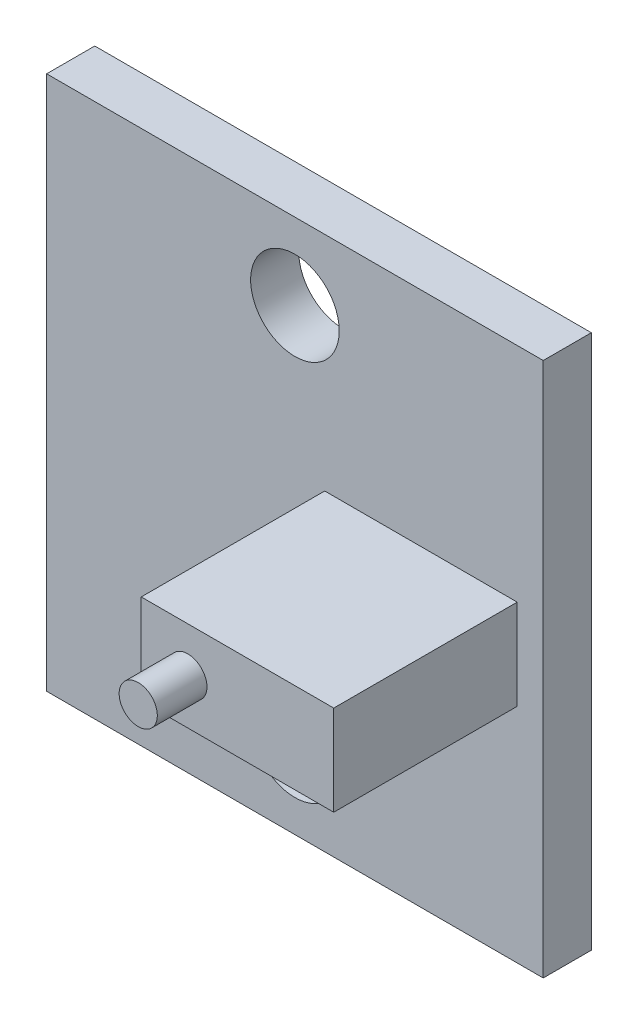
ISO-10303-21;
HEADER;
FILE_DESCRIPTION(('STEP AP214'),'2;1');
FILE_NAME('part.step','',(''),(''),'','','');
FILE_SCHEMA(('AUTOMOTIVE_DESIGN { 1 0 10303 214 1 1 1 1 }'));
ENDSEC;
DATA;
#1=APPLICATION_CONTEXT('core data for automotive mechanical design processes');
#2=APPLICATION_PROTOCOL_DEFINITION('international standard','automotive_design',2000,#1);
#3=PRODUCT_CONTEXT('',#1,'mechanical');
#4=PRODUCT('Part','Part','',(#3));
#5=PRODUCT_RELATED_PRODUCT_CATEGORY('part','',(#4));
#6=PRODUCT_DEFINITION_FORMATION('','',#4);
#7=PRODUCT_DEFINITION_CONTEXT('part definition',#1,'design');
#8=PRODUCT_DEFINITION('design','',#6,#7);
#9=PRODUCT_DEFINITION_SHAPE('','',#8);
#10=(LENGTH_UNIT() NAMED_UNIT(*) SI_UNIT(.MILLI.,.METRE.));
#11=(NAMED_UNIT(*) PLANE_ANGLE_UNIT() SI_UNIT($,.RADIAN.));
#12=(NAMED_UNIT(*) SI_UNIT($,.STERADIAN.) SOLID_ANGLE_UNIT());
#13=UNCERTAINTY_MEASURE_WITH_UNIT(LENGTH_MEASURE(1.E-05),#10,'distance_accuracy_value','');
#14=(GEOMETRIC_REPRESENTATION_CONTEXT(3) GLOBAL_UNCERTAINTY_ASSIGNED_CONTEXT((#13)) GLOBAL_UNIT_ASSIGNED_CONTEXT((#10,
#11,#12)) REPRESENTATION_CONTEXT('',''));
#15=CARTESIAN_POINT('',(0.,0.,0.));
#16=DIRECTION('',(0.,0.,1.));
#17=DIRECTION('',(1.,0.,0.));
#18=AXIS2_PLACEMENT_3D('',#15,#16,#17);
#19=CARTESIAN_POINT('',(0.,0.,1.6));
#20=DIRECTION('',(0.,0.,1.));
#21=DIRECTION('',(1.,0.,0.));
#22=AXIS2_PLACEMENT_3D('',#19,#20,#21);
#23=PLANE('',#22);
#24=CARTESIAN_POINT('',(0.,6.35,1.6));
#25=DIRECTION('',(0.,0.,1.));
#26=DIRECTION('',(1.,0.,0.));
#27=AXIS2_PLACEMENT_3D('',#24,#25,#26);
#28=CIRCLE('',#27,1.4732);
#29=CARTESIAN_POINT('',(1.4732,6.35,1.6));
#30=VERTEX_POINT('',#29);
#31=EDGE_CURVE('E135',#30,#30,#28,.T.);
#32=ORIENTED_EDGE('',*,*,#31,.F.);
#33=EDGE_LOOP('',(#32));
#34=FACE_BOUND('',#33,.T.);
#35=CARTESIAN_POINT('',(0.,-6.35,1.6));
#36=DIRECTION('',(0.,0.,1.));
#37=DIRECTION('',(1.,0.,0.));
#38=AXIS2_PLACEMENT_3D('',#35,#36,#37);
#39=CIRCLE('',#38,1.4732);
#40=CARTESIAN_POINT('',(1.4732,-6.35,1.6));
#41=VERTEX_POINT('',#40);
#42=EDGE_CURVE('E145',#41,#41,#39,.T.);
#43=ORIENTED_EDGE('',*,*,#42,.F.);
#44=EDGE_LOOP('',(#43));
#45=FACE_BOUND('',#44,.T.);
#46=DIRECTION('',(0.,-1.,0.));
#47=VECTOR('',#46,1.);
#48=CARTESIAN_POINT('',(-8.255,-8.89,1.6));
#49=LINE('',#48,#47);
#50=CARTESIAN_POINT('',(-8.255,8.89,1.6));
#51=VERTEX_POINT('',#50);
#52=CARTESIAN_POINT('',(-8.255,-8.89,1.6));
#53=VERTEX_POINT('',#52);
#54=EDGE_CURVE('E148',#51,#53,#49,.T.);
#55=ORIENTED_EDGE('',*,*,#54,.T.);
#56=DIRECTION('',(1.,0.,0.));
#57=VECTOR('',#56,1.);
#58=CARTESIAN_POINT('',(8.255,-8.89,1.6));
#59=LINE('',#58,#57);
#60=CARTESIAN_POINT('',(8.255,-8.89,1.6));
#61=VERTEX_POINT('',#60);
#62=EDGE_CURVE('E88',#53,#61,#59,.T.);
#63=ORIENTED_EDGE('',*,*,#62,.T.);
#64=DIRECTION('',(0.,1.,0.));
#65=VECTOR('',#64,1.);
#66=CARTESIAN_POINT('',(8.255,-8.89,1.6));
#67=LINE('',#66,#65);
#68=CARTESIAN_POINT('',(8.255,8.89,1.6));
#69=VERTEX_POINT('',#68);
#70=EDGE_CURVE('E151',#61,#69,#67,.T.);
#71=ORIENTED_EDGE('',*,*,#70,.T.);
#72=DIRECTION('',(-1.,0.,0.));
#73=VECTOR('',#72,1.);
#74=CARTESIAN_POINT('',(8.255,8.89,1.6));
#75=LINE('',#74,#73);
#76=EDGE_CURVE('E60',#69,#51,#75,.T.);
#77=ORIENTED_EDGE('',*,*,#76,.T.);
#78=EDGE_LOOP('',(#55,#63,#71,#77));
#79=FACE_BOUND('',#78,.T.);
#80=DIRECTION('',(-1.,0.,0.));
#81=VECTOR('',#80,1.);
#82=CARTESIAN_POINT('',(0.99,1.5,1.6));
#83=LINE('',#82,#81);
#84=CARTESIAN_POINT('',(7.39,1.5,1.6));
#85=VERTEX_POINT('',#84);
#86=CARTESIAN_POINT('',(0.99,1.5,1.6));
#87=VERTEX_POINT('',#86);
#88=EDGE_CURVE('E234',#85,#87,#83,.T.);
#89=ORIENTED_EDGE('',*,*,#88,.F.);
#90=DIRECTION('',(0.,1.,0.));
#91=VECTOR('',#90,1.);
#92=CARTESIAN_POINT('',(7.39,1.5,1.6));
#93=LINE('',#92,#91);
#94=CARTESIAN_POINT('',(7.39,-1.5,1.6));
#95=VERTEX_POINT('',#94);
#96=EDGE_CURVE('E133',#95,#85,#93,.T.);
#97=ORIENTED_EDGE('',*,*,#96,.F.);
#98=DIRECTION('',(1.,0.,0.));
#99=VECTOR('',#98,1.);
#100=CARTESIAN_POINT('',(0.990000000000001,-1.5,1.6));
#101=LINE('',#100,#99);
#102=CARTESIAN_POINT('',(0.990000000000001,-1.5,1.6));
#103=VERTEX_POINT('',#102);
#104=EDGE_CURVE('E129',#103,#95,#101,.T.);
#105=ORIENTED_EDGE('',*,*,#104,.F.);
#106=DIRECTION('',(0.,-1.,0.));
#107=VECTOR('',#106,1.);
#108=CARTESIAN_POINT('',(0.99,1.5,1.6));
#109=LINE('',#108,#107);
#110=EDGE_CURVE('E243',#87,#103,#109,.T.);
#111=ORIENTED_EDGE('',*,*,#110,.F.);
#112=EDGE_LOOP('',(#89,#97,#105,#111));
#113=FACE_BOUND('',#112,.T.);
#114=ADVANCED_FACE('F35',(#34,#45,#79,#113),#23,.T.);
#115=CARTESIAN_POINT('',(-8.255,-8.89,1.6));
#116=DIRECTION('',(1.,0.,0.));
#117=DIRECTION('',(0.,0.,-1.));
#118=AXIS2_PLACEMENT_3D('',#115,#116,#117);
#119=PLANE('',#118);
#120=DIRECTION('',(0.,-1.,0.));
#121=VECTOR('',#120,1.);
#122=CARTESIAN_POINT('',(-8.255,-8.89,0.));
#123=LINE('',#122,#121);
#124=CARTESIAN_POINT('',(-8.255,8.89,0.));
#125=VERTEX_POINT('',#124);
#126=CARTESIAN_POINT('',(-8.255,-8.89,0.));
#127=VERTEX_POINT('',#126);
#128=EDGE_CURVE('E155',#125,#127,#123,.T.);
#129=ORIENTED_EDGE('',*,*,#128,.T.);
#130=DIRECTION('',(0.,0.,-1.));
#131=VECTOR('',#130,1.);
#132=CARTESIAN_POINT('',(-8.255,-8.89,1.6));
#133=LINE('',#132,#131);
#134=EDGE_CURVE('E11',#53,#127,#133,.T.);
#135=ORIENTED_EDGE('',*,*,#134,.F.);
#136=ORIENTED_EDGE('',*,*,#54,.F.);
#137=DIRECTION('',(0.,0.,-1.));
#138=VECTOR('',#137,1.);
#139=CARTESIAN_POINT('',(-8.255,8.89,1.6));
#140=LINE('',#139,#138);
#141=EDGE_CURVE('E154',#51,#125,#140,.T.);
#142=ORIENTED_EDGE('',*,*,#141,.T.);
#143=EDGE_LOOP('',(#129,#135,#136,#142));
#144=FACE_BOUND('',#143,.T.);
#145=ADVANCED_FACE('F37',(#144),#119,.F.);
#146=CARTESIAN_POINT('',(8.255,-8.89,1.6));
#147=DIRECTION('',(0.,1.,0.));
#148=DIRECTION('',(-1.,0.,0.));
#149=AXIS2_PLACEMENT_3D('',#146,#147,#148);
#150=PLANE('',#149);
#151=DIRECTION('',(1.,0.,0.));
#152=VECTOR('',#151,1.);
#153=CARTESIAN_POINT('',(8.255,-8.89,0.));
#154=LINE('',#153,#152);
#155=CARTESIAN_POINT('',(8.255,-8.89,0.));
#156=VERTEX_POINT('',#155);
#157=EDGE_CURVE('E158',#127,#156,#154,.T.);
#158=ORIENTED_EDGE('',*,*,#157,.T.);
#159=DIRECTION('',(0.,0.,-1.));
#160=VECTOR('',#159,1.);
#161=CARTESIAN_POINT('',(8.255,-8.89,1.6));
#162=LINE('',#161,#160);
#163=EDGE_CURVE('E44',#61,#156,#162,.T.);
#164=ORIENTED_EDGE('',*,*,#163,.F.);
#165=ORIENTED_EDGE('',*,*,#62,.F.);
#166=ORIENTED_EDGE('',*,*,#134,.T.);
#167=EDGE_LOOP('',(#158,#164,#165,#166));
#168=FACE_BOUND('',#167,.T.);
#169=ADVANCED_FACE('F188',(#168),#150,.F.);
#170=CARTESIAN_POINT('',(8.255,-8.89,1.6));
#171=DIRECTION('',(-1.,0.,0.));
#172=DIRECTION('',(0.,0.,1.));
#173=AXIS2_PLACEMENT_3D('',#170,#171,#172);
#174=PLANE('',#173);
#175=DIRECTION('',(0.,1.,0.));
#176=VECTOR('',#175,1.);
#177=CARTESIAN_POINT('',(8.255,-8.89,0.));
#178=LINE('',#177,#176);
#179=CARTESIAN_POINT('',(8.255,8.89,0.));
#180=VERTEX_POINT('',#179);
#181=EDGE_CURVE('E160',#156,#180,#178,.T.);
#182=ORIENTED_EDGE('',*,*,#181,.T.);
#183=DIRECTION('',(0.,0.,-1.));
#184=VECTOR('',#183,1.);
#185=CARTESIAN_POINT('',(8.255,8.89,1.6));
#186=LINE('',#185,#184);
#187=EDGE_CURVE('E164',#69,#180,#186,.T.);
#188=ORIENTED_EDGE('',*,*,#187,.F.);
#189=ORIENTED_EDGE('',*,*,#70,.F.);
#190=ORIENTED_EDGE('',*,*,#163,.T.);
#191=EDGE_LOOP('',(#182,#188,#189,#190));
#192=FACE_BOUND('',#191,.T.);
#193=ADVANCED_FACE('F170',(#192),#174,.F.);
#194=CARTESIAN_POINT('',(8.255,8.89,1.6));
#195=DIRECTION('',(0.,-1.,0.));
#196=DIRECTION('',(1.,0.,0.));
#197=AXIS2_PLACEMENT_3D('',#194,#195,#196);
#198=PLANE('',#197);
#199=DIRECTION('',(-1.,0.,0.));
#200=VECTOR('',#199,1.);
#201=CARTESIAN_POINT('',(8.255,8.89,0.));
#202=LINE('',#201,#200);
#203=EDGE_CURVE('E81',#180,#125,#202,.T.);
#204=ORIENTED_EDGE('',*,*,#203,.T.);
#205=ORIENTED_EDGE('',*,*,#141,.F.);
#206=ORIENTED_EDGE('',*,*,#76,.F.);
#207=ORIENTED_EDGE('',*,*,#187,.T.);
#208=EDGE_LOOP('',(#204,#205,#206,#207));
#209=FACE_BOUND('',#208,.T.);
#210=ADVANCED_FACE('F178',(#209),#198,.F.);
#211=CARTESIAN_POINT('',(0.,0.,0.));
#212=DIRECTION('',(0.,0.,1.));
#213=DIRECTION('',(1.,0.,0.));
#214=AXIS2_PLACEMENT_3D('',#211,#212,#213);
#215=PLANE('',#214);
#216=CARTESIAN_POINT('',(0.,6.35,0.));
#217=DIRECTION('',(0.,0.,1.));
#218=DIRECTION('',(1.,0.,0.));
#219=AXIS2_PLACEMENT_3D('',#216,#217,#218);
#220=CIRCLE('',#219,1.4732);
#221=CARTESIAN_POINT('',(1.4732,6.35,0.));
#222=VERTEX_POINT('',#221);
#223=EDGE_CURVE('E138',#222,#222,#220,.T.);
#224=ORIENTED_EDGE('',*,*,#223,.T.);
#225=EDGE_LOOP('',(#224));
#226=FACE_BOUND('',#225,.T.);
#227=CARTESIAN_POINT('',(0.,-6.35,0.));
#228=DIRECTION('',(0.,0.,1.));
#229=DIRECTION('',(1.,0.,0.));
#230=AXIS2_PLACEMENT_3D('',#227,#228,#229);
#231=CIRCLE('',#230,1.4732);
#232=CARTESIAN_POINT('',(1.4732,-6.35,0.));
#233=VERTEX_POINT('',#232);
#234=EDGE_CURVE('E39',#233,#233,#231,.T.);
#235=ORIENTED_EDGE('',*,*,#234,.T.);
#236=EDGE_LOOP('',(#235));
#237=FACE_BOUND('',#236,.T.);
#238=ORIENTED_EDGE('',*,*,#128,.F.);
#239=ORIENTED_EDGE('',*,*,#203,.F.);
#240=ORIENTED_EDGE('',*,*,#181,.F.);
#241=ORIENTED_EDGE('',*,*,#157,.F.);
#242=EDGE_LOOP('',(#238,#239,#240,#241));
#243=FACE_BOUND('',#242,.T.);
#244=ADVANCED_FACE('F174',(#226,#237,#243),#215,.F.);
#245=CARTESIAN_POINT('',(0.,-6.35,1.6));
#246=DIRECTION('',(0.,0.,1.));
#247=DIRECTION('',(1.,0.,0.));
#248=AXIS2_PLACEMENT_3D('',#245,#246,#247);
#249=CYLINDRICAL_SURFACE('',#248,1.4732);
#250=ORIENTED_EDGE('',*,*,#42,.T.);
#251=EDGE_LOOP('',(#250));
#252=FACE_BOUND('',#251,.T.);
#253=ORIENTED_EDGE('',*,*,#234,.F.);
#254=EDGE_LOOP('',(#253));
#255=FACE_BOUND('',#254,.T.);
#256=ADVANCED_FACE('F185',(#252,#255),#249,.F.);
#257=CARTESIAN_POINT('',(0.,6.35,1.6));
#258=DIRECTION('',(0.,0.,1.));
#259=DIRECTION('',(1.,0.,0.));
#260=AXIS2_PLACEMENT_3D('',#257,#258,#259);
#261=CYLINDRICAL_SURFACE('',#260,1.4732);
#262=ORIENTED_EDGE('',*,*,#31,.T.);
#263=EDGE_LOOP('',(#262));
#264=FACE_BOUND('',#263,.T.);
#265=ORIENTED_EDGE('',*,*,#223,.F.);
#266=EDGE_LOOP('',(#265));
#267=FACE_BOUND('',#266,.T.);
#268=ADVANCED_FACE('F201',(#264,#267),#261,.F.);
#269=CARTESIAN_POINT('',(7.39,1.5,7.7));
#270=DIRECTION('',(-1.,0.,0.));
#271=DIRECTION('',(0.,0.,1.));
#272=AXIS2_PLACEMENT_3D('',#269,#270,#271);
#273=PLANE('',#272);
#274=ORIENTED_EDGE('',*,*,#96,.T.);
#275=DIRECTION('',(0.,0.,-1.));
#276=VECTOR('',#275,1.);
#277=CARTESIAN_POINT('',(7.39,1.5,7.7));
#278=LINE('',#277,#276);
#279=CARTESIAN_POINT('',(7.39,1.5,7.7));
#280=VERTEX_POINT('',#279);
#281=EDGE_CURVE('E114',#280,#85,#278,.T.);
#282=ORIENTED_EDGE('',*,*,#281,.F.);
#283=DIRECTION('',(0.,1.,0.));
#284=VECTOR('',#283,1.);
#285=CARTESIAN_POINT('',(7.39,1.5,7.7));
#286=LINE('',#285,#284);
#287=CARTESIAN_POINT('',(7.39,-1.5,7.7));
#288=VERTEX_POINT('',#287);
#289=EDGE_CURVE('E121',#288,#280,#286,.T.);
#290=ORIENTED_EDGE('',*,*,#289,.F.);
#291=DIRECTION('',(0.,0.,-1.));
#292=VECTOR('',#291,1.);
#293=CARTESIAN_POINT('',(7.39,-1.5,7.7));
#294=LINE('',#293,#292);
#295=EDGE_CURVE('E240',#288,#95,#294,.T.);
#296=ORIENTED_EDGE('',*,*,#295,.T.);
#297=EDGE_LOOP('',(#274,#282,#290,#296));
#298=FACE_BOUND('',#297,.T.);
#299=ADVANCED_FACE('F131',(#298),#273,.F.);
#300=CARTESIAN_POINT('',(0.99,1.5,7.7));
#301=DIRECTION('',(0.,-1.,0.));
#302=DIRECTION('',(0.,0.,-1.));
#303=AXIS2_PLACEMENT_3D('',#300,#301,#302);
#304=PLANE('',#303);
#305=ORIENTED_EDGE('',*,*,#88,.T.);
#306=DIRECTION('',(0.,0.,-1.));
#307=VECTOR('',#306,1.);
#308=CARTESIAN_POINT('',(0.99,1.5,7.7));
#309=LINE('',#308,#307);
#310=CARTESIAN_POINT('',(0.99,1.5,7.7));
#311=VERTEX_POINT('',#310);
#312=EDGE_CURVE('E117',#311,#87,#309,.T.);
#313=ORIENTED_EDGE('',*,*,#312,.F.);
#314=DIRECTION('',(-1.,0.,0.));
#315=VECTOR('',#314,1.);
#316=CARTESIAN_POINT('',(0.99,1.5,7.7));
#317=LINE('',#316,#315);
#318=EDGE_CURVE('E110',#280,#311,#317,.T.);
#319=ORIENTED_EDGE('',*,*,#318,.F.);
#320=ORIENTED_EDGE('',*,*,#281,.T.);
#321=EDGE_LOOP('',(#305,#313,#319,#320));
#322=FACE_BOUND('',#321,.T.);
#323=ADVANCED_FACE('F112',(#322),#304,.F.);
#324=CARTESIAN_POINT('',(0.99,1.5,7.7));
#325=DIRECTION('',(1.,0.,0.));
#326=DIRECTION('',(0.,1.,0.));
#327=AXIS2_PLACEMENT_3D('',#324,#325,#326);
#328=PLANE('',#327);
#329=ORIENTED_EDGE('',*,*,#110,.T.);
#330=DIRECTION('',(0.,0.,-1.));
#331=VECTOR('',#330,1.);
#332=CARTESIAN_POINT('',(0.990000000000001,-1.5,7.7));
#333=LINE('',#332,#331);
#334=CARTESIAN_POINT('',(0.990000000000001,-1.5,7.7));
#335=VERTEX_POINT('',#334);
#336=EDGE_CURVE('E51',#335,#103,#333,.T.);
#337=ORIENTED_EDGE('',*,*,#336,.F.);
#338=DIRECTION('',(0.,-1.,0.));
#339=VECTOR('',#338,1.);
#340=CARTESIAN_POINT('',(0.99,1.5,7.7));
#341=LINE('',#340,#339);
#342=EDGE_CURVE('E120',#311,#335,#341,.T.);
#343=ORIENTED_EDGE('',*,*,#342,.F.);
#344=ORIENTED_EDGE('',*,*,#312,.T.);
#345=EDGE_LOOP('',(#329,#337,#343,#344));
#346=FACE_BOUND('',#345,.T.);
#347=ADVANCED_FACE('F210',(#346),#328,.F.);
#348=CARTESIAN_POINT('',(0.990000000000001,-1.5,7.7));
#349=DIRECTION('',(0.,1.,0.));
#350=DIRECTION('',(0.,0.,1.));
#351=AXIS2_PLACEMENT_3D('',#348,#349,#350);
#352=PLANE('',#351);
#353=ORIENTED_EDGE('',*,*,#104,.T.);
#354=ORIENTED_EDGE('',*,*,#295,.F.);
#355=DIRECTION('',(1.,0.,0.));
#356=VECTOR('',#355,1.);
#357=CARTESIAN_POINT('',(0.990000000000001,-1.5,7.7));
#358=LINE('',#357,#356);
#359=EDGE_CURVE('E125',#335,#288,#358,.T.);
#360=ORIENTED_EDGE('',*,*,#359,.F.);
#361=ORIENTED_EDGE('',*,*,#336,.T.);
#362=EDGE_LOOP('',(#353,#354,#360,#361));
#363=FACE_BOUND('',#362,.T.);
#364=ADVANCED_FACE('F213',(#363),#352,.F.);
#365=CARTESIAN_POINT('',(0.,0.,7.7));
#366=DIRECTION('',(0.,0.,1.));
#367=DIRECTION('',(1.,0.,0.));
#368=AXIS2_PLACEMENT_3D('',#365,#366,#367);
#369=PLANE('',#368);
#370=CARTESIAN_POINT('',(2.54,0.,7.7));
#371=DIRECTION('',(0.,0.,1.));
#372=DIRECTION('',(1.,0.,0.));
#373=AXIS2_PLACEMENT_3D('',#370,#371,#372);
#374=CIRCLE('',#373,0.635);
#375=CARTESIAN_POINT('',(3.175,0.,7.7));
#376=VERTEX_POINT('',#375);
#377=EDGE_CURVE('E232',#376,#376,#374,.T.);
#378=ORIENTED_EDGE('',*,*,#377,.F.);
#379=EDGE_LOOP('',(#378));
#380=FACE_BOUND('',#379,.T.);
#381=ORIENTED_EDGE('',*,*,#289,.T.);
#382=ORIENTED_EDGE('',*,*,#318,.T.);
#383=ORIENTED_EDGE('',*,*,#342,.T.);
#384=ORIENTED_EDGE('',*,*,#359,.T.);
#385=EDGE_LOOP('',(#381,#382,#383,#384));
#386=FACE_BOUND('',#385,.T.);
#387=ADVANCED_FACE('F124',(#380,#386),#369,.T.);
#388=CARTESIAN_POINT('',(2.54,0.,9.35));
#389=DIRECTION('',(0.,0.,-1.));
#390=DIRECTION('',(-1.,0.,0.));
#391=AXIS2_PLACEMENT_3D('',#388,#389,#390);
#392=CYLINDRICAL_SURFACE('',#391,0.635);
#393=CARTESIAN_POINT('',(2.54,0.,9.35));
#394=DIRECTION('',(0.,0.,1.));
#395=DIRECTION('',(1.,0.,0.));
#396=AXIS2_PLACEMENT_3D('',#393,#394,#395);
#397=CIRCLE('',#396,0.635);
#398=CARTESIAN_POINT('',(3.175,0.,9.35));
#399=VERTEX_POINT('',#398);
#400=EDGE_CURVE('E231',#399,#399,#397,.T.);
#401=ORIENTED_EDGE('',*,*,#400,.F.);
#402=EDGE_LOOP('',(#401));
#403=FACE_BOUND('',#402,.T.);
#404=ORIENTED_EDGE('',*,*,#377,.T.);
#405=EDGE_LOOP('',(#404));
#406=FACE_BOUND('',#405,.T.);
#407=ADVANCED_FACE('F219',(#403,#406),#392,.T.);
#408=CARTESIAN_POINT('',(2.54,0.,9.35));
#409=DIRECTION('',(0.,0.,1.));
#410=DIRECTION('',(1.,0.,0.));
#411=AXIS2_PLACEMENT_3D('',#408,#409,#410);
#412=PLANE('',#411);
#413=ORIENTED_EDGE('',*,*,#400,.T.);
#414=EDGE_LOOP('',(#413));
#415=FACE_BOUND('',#414,.T.);
#416=ADVANCED_FACE('F223',(#415),#412,.T.);
#417=CLOSED_SHELL('',(#114,#145,#169,#193,#210,#244,#256,#268,#299,#323,#347,#364,#387,#407,#416));
#418=MANIFOLD_SOLID_BREP('B2',#417);
#419=ADVANCED_BREP_SHAPE_REPRESENTATION('',(#18,#418),#14);
#420=SHAPE_DEFINITION_REPRESENTATION(#9,#419);
ENDSEC;
END-ISO-10303-21;
